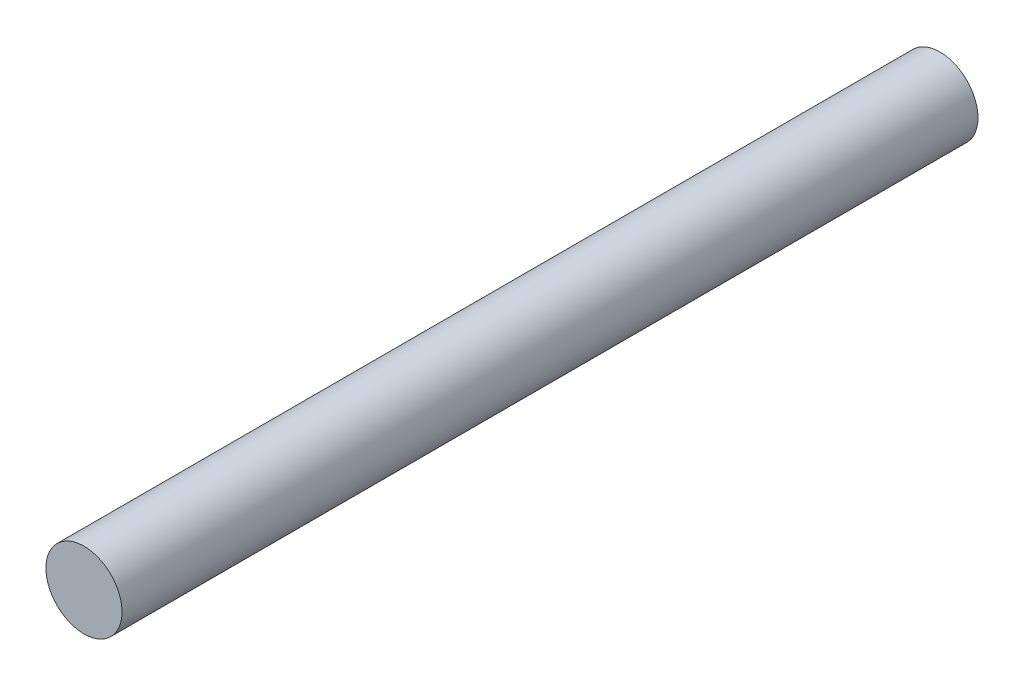
ISO-10303-21;
HEADER;
FILE_DESCRIPTION(('STEP AP214'),'2;1');
FILE_NAME('part.step','',(''),(''),'','','');
FILE_SCHEMA(('AUTOMOTIVE_DESIGN { 1 0 10303 214 1 1 1 1 }'));
ENDSEC;
DATA;
#1=APPLICATION_CONTEXT('core data for automotive mechanical design processes');
#2=APPLICATION_PROTOCOL_DEFINITION('international standard','automotive_design',2000,#1);
#3=PRODUCT_CONTEXT('',#1,'mechanical');
#4=PRODUCT('Part','Part','',(#3));
#5=PRODUCT_RELATED_PRODUCT_CATEGORY('part','',(#4));
#6=PRODUCT_DEFINITION_FORMATION('','',#4);
#7=PRODUCT_DEFINITION_CONTEXT('part definition',#1,'design');
#8=PRODUCT_DEFINITION('design','',#6,#7);
#9=PRODUCT_DEFINITION_SHAPE('','',#8);
#10=(LENGTH_UNIT() NAMED_UNIT(*) SI_UNIT(.MILLI.,.METRE.));
#11=(NAMED_UNIT(*) PLANE_ANGLE_UNIT() SI_UNIT($,.RADIAN.));
#12=(NAMED_UNIT(*) SI_UNIT($,.STERADIAN.) SOLID_ANGLE_UNIT());
#13=UNCERTAINTY_MEASURE_WITH_UNIT(LENGTH_MEASURE(1.E-05),#10,'distance_accuracy_value','');
#14=(GEOMETRIC_REPRESENTATION_CONTEXT(3) GLOBAL_UNCERTAINTY_ASSIGNED_CONTEXT((#13)) GLOBAL_UNIT_ASSIGNED_CONTEXT((#10,
#11,#12)) REPRESENTATION_CONTEXT('',''));
#15=CARTESIAN_POINT('',(0.,0.,0.));
#16=DIRECTION('',(0.,0.,1.));
#17=DIRECTION('',(1.,0.,0.));
#18=AXIS2_PLACEMENT_3D('',#15,#16,#17);
#19=CARTESIAN_POINT('',(0.,0.,450.));
#20=DIRECTION('',(0.,0.,-1.));
#21=DIRECTION('',(-1.,0.,0.));
#22=AXIS2_PLACEMENT_3D('',#19,#20,#21);
#23=CYLINDRICAL_SURFACE('',#22,20.);
#24=CARTESIAN_POINT('',(0.,0.,450.));
#25=DIRECTION('',(0.,0.,1.));
#26=DIRECTION('',(1.,0.,0.));
#27=AXIS2_PLACEMENT_3D('',#24,#25,#26);
#28=CIRCLE('',#27,20.);
#29=CARTESIAN_POINT('',(20.,0.,450.));
#30=VERTEX_POINT('',#29);
#31=EDGE_CURVE('E10',#30,#30,#28,.T.);
#32=ORIENTED_EDGE('',*,*,#31,.F.);
#33=EDGE_LOOP('',(#32));
#34=FACE_BOUND('',#33,.T.);
#35=CARTESIAN_POINT('',(0.,0.,0.));
#36=DIRECTION('',(0.,0.,1.));
#37=DIRECTION('',(1.,0.,0.));
#38=AXIS2_PLACEMENT_3D('',#35,#36,#37);
#39=CIRCLE('',#38,20.);
#40=CARTESIAN_POINT('',(20.,0.,0.));
#41=VERTEX_POINT('',#40);
#42=EDGE_CURVE('E36',#41,#41,#39,.T.);
#43=ORIENTED_EDGE('',*,*,#42,.T.);
#44=EDGE_LOOP('',(#43));
#45=FACE_BOUND('',#44,.T.);
#46=ADVANCED_FACE('F33',(#34,#45),#23,.T.);
#47=CARTESIAN_POINT('',(0.,0.,450.));
#48=DIRECTION('',(0.,0.,1.));
#49=DIRECTION('',(1.,0.,0.));
#50=AXIS2_PLACEMENT_3D('',#47,#48,#49);
#51=PLANE('',#50);
#52=ORIENTED_EDGE('',*,*,#31,.T.);
#53=EDGE_LOOP('',(#52));
#54=FACE_BOUND('',#53,.T.);
#55=ADVANCED_FACE('F48',(#54),#51,.T.);
#56=CARTESIAN_POINT('',(0.,0.,0.));
#57=DIRECTION('',(0.,0.,1.));
#58=DIRECTION('',(1.,0.,0.));
#59=AXIS2_PLACEMENT_3D('',#56,#57,#58);
#60=PLANE('',#59);
#61=ORIENTED_EDGE('',*,*,#42,.F.);
#62=EDGE_LOOP('',(#61));
#63=FACE_BOUND('',#62,.T.);
#64=ADVANCED_FACE('F46',(#63),#60,.F.);
#65=CLOSED_SHELL('',(#46,#55,#64));
#66=MANIFOLD_SOLID_BREP('B2',#65);
#67=ADVANCED_BREP_SHAPE_REPRESENTATION('',(#18,#66),#14);
#68=SHAPE_DEFINITION_REPRESENTATION(#9,#67);
ENDSEC;
END-ISO-10303-21;
